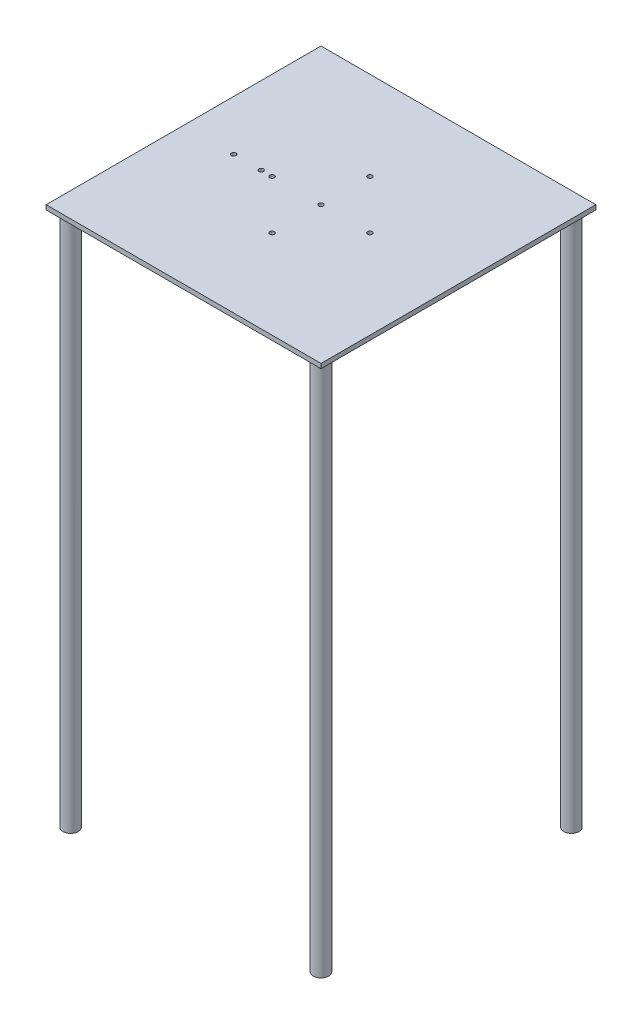
ISO-10303-21;
HEADER;
FILE_DESCRIPTION(('STEP AP214'),'2;1');
FILE_NAME('part.step','',(''),(''),'','','');
FILE_SCHEMA(('AUTOMOTIVE_DESIGN { 1 0 10303 214 1 1 1 1 }'));
ENDSEC;
DATA;
#1=APPLICATION_CONTEXT('core data for automotive mechanical design processes');
#2=APPLICATION_PROTOCOL_DEFINITION('international standard','automotive_design',2000,#1);
#3=PRODUCT_CONTEXT('',#1,'mechanical');
#4=PRODUCT('Part','Part','',(#3));
#5=PRODUCT_RELATED_PRODUCT_CATEGORY('part','',(#4));
#6=PRODUCT_DEFINITION_FORMATION('','',#4);
#7=PRODUCT_DEFINITION_CONTEXT('part definition',#1,'design');
#8=PRODUCT_DEFINITION('design','',#6,#7);
#9=PRODUCT_DEFINITION_SHAPE('','',#8);
#10=(LENGTH_UNIT() NAMED_UNIT(*) SI_UNIT(.MILLI.,.METRE.));
#11=(NAMED_UNIT(*) PLANE_ANGLE_UNIT() SI_UNIT($,.RADIAN.));
#12=(NAMED_UNIT(*) SI_UNIT($,.STERADIAN.) SOLID_ANGLE_UNIT());
#13=UNCERTAINTY_MEASURE_WITH_UNIT(LENGTH_MEASURE(1.E-05),#10,'distance_accuracy_value','');
#14=(GEOMETRIC_REPRESENTATION_CONTEXT(3) GLOBAL_UNCERTAINTY_ASSIGNED_CONTEXT((#13)) GLOBAL_UNIT_ASSIGNED_CONTEXT((#10,
#11,#12)) REPRESENTATION_CONTEXT('',''));
#15=CARTESIAN_POINT('',(0.,0.,0.));
#16=DIRECTION('',(0.,0.,1.));
#17=DIRECTION('',(1.,0.,0.));
#18=AXIS2_PLACEMENT_3D('',#15,#16,#17);
#19=CARTESIAN_POINT('',(0.,3.,0.));
#20=DIRECTION('',(0.,1.,0.));
#21=DIRECTION('',(0.,0.,1.));
#22=AXIS2_PLACEMENT_3D('',#19,#20,#21);
#23=PLANE('',#22);
#24=CARTESIAN_POINT('',(-147.18268,3.,-90.));
#25=DIRECTION('',(0.,1.,0.));
#26=DIRECTION('',(0.,0.,1.));
#27=AXIS2_PLACEMENT_3D('',#24,#25,#26);
#28=CIRCLE('',#27,1.5);
#29=CARTESIAN_POINT('',(-147.18268,3.,-88.5));
#30=VERTEX_POINT('',#29);
#31=EDGE_CURVE('E164',#30,#30,#28,.T.);
#32=ORIENTED_EDGE('',*,*,#31,.F.);
#33=EDGE_LOOP('',(#32));
#34=FACE_BOUND('',#33,.T.);
#35=CARTESIAN_POINT('',(-129.18268,3.,-90.));
#36=DIRECTION('',(0.,1.,0.));
#37=DIRECTION('',(0.,0.,-1.));
#38=AXIS2_PLACEMENT_3D('',#35,#36,#37);
#39=CIRCLE('',#38,1.5);
#40=CARTESIAN_POINT('',(-129.18268,3.,-91.5));
#41=VERTEX_POINT('',#40);
#42=EDGE_CURVE('E352',#41,#41,#39,.T.);
#43=ORIENTED_EDGE('',*,*,#42,.F.);
#44=EDGE_LOOP('',(#43));
#45=FACE_BOUND('',#44,.T.);
#46=CARTESIAN_POINT('',(-90.,3.,-122.));
#47=DIRECTION('',(0.,1.,0.));
#48=DIRECTION('',(0.,0.,1.));
#49=AXIS2_PLACEMENT_3D('',#46,#47,#48);
#50=CIRCLE('',#49,1.5);
#51=CARTESIAN_POINT('',(-90.,3.,-120.5));
#52=VERTEX_POINT('',#51);
#53=EDGE_CURVE('E168',#52,#52,#50,.T.);
#54=ORIENTED_EDGE('',*,*,#53,.F.);
#55=EDGE_LOOP('',(#54));
#56=FACE_BOUND('',#55,.T.);
#57=CARTESIAN_POINT('',(-58.,3.,-90.));
#58=DIRECTION('',(0.,1.,0.));
#59=DIRECTION('',(0.,0.,1.));
#60=AXIS2_PLACEMENT_3D('',#57,#58,#59);
#61=CIRCLE('',#60,1.5);
#62=CARTESIAN_POINT('',(-58.,3.,-88.5));
#63=VERTEX_POINT('',#62);
#64=EDGE_CURVE('E176',#63,#63,#61,.T.);
#65=ORIENTED_EDGE('',*,*,#64,.F.);
#66=EDGE_LOOP('',(#65));
#67=FACE_BOUND('',#66,.T.);
#68=DIRECTION('',(0.,0.,-1.));
#69=VECTOR('',#68,1.);
#70=CARTESIAN_POINT('',(0.,3.,0.));
#71=LINE('',#70,#69);
#72=CARTESIAN_POINT('',(0.,3.,0.));
#73=VERTEX_POINT('',#72);
#74=CARTESIAN_POINT('',(0.,3.,-180.));
#75=VERTEX_POINT('',#74);
#76=EDGE_CURVE('E86',#73,#75,#71,.T.);
#77=ORIENTED_EDGE('',*,*,#76,.T.);
#78=DIRECTION('',(-1.,0.,0.));
#79=VECTOR('',#78,1.);
#80=CARTESIAN_POINT('',(0.,3.,-180.));
#81=LINE('',#80,#79);
#82=CARTESIAN_POINT('',(-180.,3.,-180.));
#83=VERTEX_POINT('',#82);
#84=EDGE_CURVE('E81',#75,#83,#81,.T.);
#85=ORIENTED_EDGE('',*,*,#84,.T.);
#86=DIRECTION('',(0.,0.,1.));
#87=VECTOR('',#86,1.);
#88=CARTESIAN_POINT('',(-180.,3.,0.));
#89=LINE('',#88,#87);
#90=CARTESIAN_POINT('',(-180.,3.,0.));
#91=VERTEX_POINT('',#90);
#92=EDGE_CURVE('E84',#83,#91,#89,.T.);
#93=ORIENTED_EDGE('',*,*,#92,.T.);
#94=DIRECTION('',(1.,0.,0.));
#95=VECTOR('',#94,1.);
#96=CARTESIAN_POINT('',(0.,3.,0.));
#97=LINE('',#96,#95);
#98=EDGE_CURVE('E50',#91,#73,#97,.T.);
#99=ORIENTED_EDGE('',*,*,#98,.T.);
#100=EDGE_LOOP('',(#77,#85,#93,#99));
#101=FACE_BOUND('',#100,.T.);
#102=CARTESIAN_POINT('',(-90.,3.,-90.));
#103=DIRECTION('',(0.,1.,0.));
#104=DIRECTION('',(0.,0.,1.));
#105=AXIS2_PLACEMENT_3D('',#102,#103,#104);
#106=CIRCLE('',#105,1.5);
#107=CARTESIAN_POINT('',(-90.,3.,-88.5));
#108=VERTEX_POINT('',#107);
#109=EDGE_CURVE('E104',#108,#108,#106,.T.);
#110=ORIENTED_EDGE('',*,*,#109,.F.);
#111=EDGE_LOOP('',(#110));
#112=FACE_BOUND('',#111,.T.);
#113=CARTESIAN_POINT('',(-122.,3.,-90.));
#114=DIRECTION('',(0.,1.,0.));
#115=DIRECTION('',(0.,0.,-1.));
#116=AXIS2_PLACEMENT_3D('',#113,#114,#115);
#117=CIRCLE('',#116,1.50000000000001);
#118=CARTESIAN_POINT('',(-122.,3.,-91.5));
#119=VERTEX_POINT('',#118);
#120=EDGE_CURVE('E172',#119,#119,#117,.T.);
#121=ORIENTED_EDGE('',*,*,#120,.F.);
#122=EDGE_LOOP('',(#121));
#123=FACE_BOUND('',#122,.T.);
#124=CARTESIAN_POINT('',(-90.,3.,-58.));
#125=DIRECTION('',(0.,1.,0.));
#126=DIRECTION('',(0.,0.,-1.));
#127=AXIS2_PLACEMENT_3D('',#124,#125,#126);
#128=CIRCLE('',#127,1.5);
#129=CARTESIAN_POINT('',(-90.,3.,-59.5));
#130=VERTEX_POINT('',#129);
#131=EDGE_CURVE('E160',#130,#130,#128,.T.);
#132=ORIENTED_EDGE('',*,*,#131,.F.);
#133=EDGE_LOOP('',(#132));
#134=FACE_BOUND('',#133,.T.);
#135=ADVANCED_FACE('F33',(#34,#45,#56,#67,#101,#112,#123,#134),#23,.T.);
#136=CARTESIAN_POINT('',(0.,0.,0.));
#137=DIRECTION('',(0.,1.,0.));
#138=DIRECTION('',(0.,0.,1.));
#139=AXIS2_PLACEMENT_3D('',#136,#137,#138);
#140=PLANE('',#139);
#141=CARTESIAN_POINT('',(-172.,0.,-172.));
#142=DIRECTION('',(0.,1.,0.));
#143=DIRECTION('',(0.,0.,1.));
#144=AXIS2_PLACEMENT_3D('',#141,#142,#143);
#145=CIRCLE('',#144,4.99999999999998);
#146=CARTESIAN_POINT('',(-172.,0.,-167.));
#147=VERTEX_POINT('',#146);
#148=EDGE_CURVE('E11',#147,#147,#145,.F.);
#149=ORIENTED_EDGE('',*,*,#148,.F.);
#150=EDGE_LOOP('',(#149));
#151=FACE_BOUND('',#150,.T.);
#152=CARTESIAN_POINT('',(-8.00000000000012,0.,-172.));
#153=DIRECTION('',(0.,1.,0.));
#154=DIRECTION('',(0.,0.,1.));
#155=AXIS2_PLACEMENT_3D('',#152,#153,#154);
#156=CIRCLE('',#155,4.99999999999999);
#157=CARTESIAN_POINT('',(-8.00000000000012,0.,-167.));
#158=VERTEX_POINT('',#157);
#159=EDGE_CURVE('E42',#158,#158,#156,.F.);
#160=ORIENTED_EDGE('',*,*,#159,.F.);
#161=EDGE_LOOP('',(#160));
#162=FACE_BOUND('',#161,.T.);
#163=CARTESIAN_POINT('',(-8.00000000000001,0.,-7.99999999999998));
#164=DIRECTION('',(0.,1.,0.));
#165=DIRECTION('',(0.,0.,1.));
#166=AXIS2_PLACEMENT_3D('',#163,#164,#165);
#167=CIRCLE('',#166,4.99999999999999);
#168=CARTESIAN_POINT('',(-8.00000000000001,0.,-2.99999999999999));
#169=VERTEX_POINT('',#168);
#170=EDGE_CURVE('E114',#169,#169,#167,.F.);
#171=ORIENTED_EDGE('',*,*,#170,.F.);
#172=EDGE_LOOP('',(#171));
#173=FACE_BOUND('',#172,.T.);
#174=CARTESIAN_POINT('',(-172.,0.,-8.));
#175=DIRECTION('',(0.,1.,0.));
#176=DIRECTION('',(0.,0.,1.));
#177=AXIS2_PLACEMENT_3D('',#174,#175,#176);
#178=CIRCLE('',#177,4.99999999999999);
#179=CARTESIAN_POINT('',(-172.,0.,-3.00000000000001));
#180=VERTEX_POINT('',#179);
#181=EDGE_CURVE('E111',#180,#180,#178,.F.);
#182=ORIENTED_EDGE('',*,*,#181,.F.);
#183=EDGE_LOOP('',(#182));
#184=FACE_BOUND('',#183,.T.);
#185=CARTESIAN_POINT('',(-147.18268,0.,-90.));
#186=DIRECTION('',(0.,1.,0.));
#187=DIRECTION('',(0.,0.,1.));
#188=AXIS2_PLACEMENT_3D('',#185,#186,#187);
#189=CIRCLE('',#188,1.5);
#190=CARTESIAN_POINT('',(-147.18268,0.,-88.5));
#191=VERTEX_POINT('',#190);
#192=EDGE_CURVE('E133',#191,#191,#189,.T.);
#193=ORIENTED_EDGE('',*,*,#192,.T.);
#194=EDGE_LOOP('',(#193));
#195=FACE_BOUND('',#194,.T.);
#196=CARTESIAN_POINT('',(-129.18268,0.,-90.));
#197=DIRECTION('',(0.,1.,0.));
#198=DIRECTION('',(0.,0.,-1.));
#199=AXIS2_PLACEMENT_3D('',#196,#197,#198);
#200=CIRCLE('',#199,1.5);
#201=CARTESIAN_POINT('',(-129.18268,0.,-91.5));
#202=VERTEX_POINT('',#201);
#203=EDGE_CURVE('E137',#202,#202,#200,.T.);
#204=ORIENTED_EDGE('',*,*,#203,.T.);
#205=EDGE_LOOP('',(#204));
#206=FACE_BOUND('',#205,.T.);
#207=DIRECTION('',(0.,0.,-1.));
#208=VECTOR('',#207,1.);
#209=CARTESIAN_POINT('',(0.,0.,0.));
#210=LINE('',#209,#208);
#211=CARTESIAN_POINT('',(0.,0.,0.));
#212=VERTEX_POINT('',#211);
#213=CARTESIAN_POINT('',(0.,0.,-180.));
#214=VERTEX_POINT('',#213);
#215=EDGE_CURVE('E101',#212,#214,#210,.T.);
#216=ORIENTED_EDGE('',*,*,#215,.F.);
#217=DIRECTION('',(1.,0.,0.));
#218=VECTOR('',#217,1.);
#219=CARTESIAN_POINT('',(0.,0.,0.));
#220=LINE('',#219,#218);
#221=CARTESIAN_POINT('',(-180.,0.,0.));
#222=VERTEX_POINT('',#221);
#223=EDGE_CURVE('E73',#222,#212,#220,.T.);
#224=ORIENTED_EDGE('',*,*,#223,.F.);
#225=DIRECTION('',(0.,0.,1.));
#226=VECTOR('',#225,1.);
#227=CARTESIAN_POINT('',(-180.,0.,0.));
#228=LINE('',#227,#226);
#229=CARTESIAN_POINT('',(-180.,0.,-180.));
#230=VERTEX_POINT('',#229);
#231=EDGE_CURVE('E67',#230,#222,#228,.T.);
#232=ORIENTED_EDGE('',*,*,#231,.F.);
#233=DIRECTION('',(-1.,0.,0.));
#234=VECTOR('',#233,1.);
#235=CARTESIAN_POINT('',(0.,0.,-180.));
#236=LINE('',#235,#234);
#237=EDGE_CURVE('E91',#214,#230,#236,.T.);
#238=ORIENTED_EDGE('',*,*,#237,.F.);
#239=EDGE_LOOP('',(#216,#224,#232,#238));
#240=FACE_BOUND('',#239,.T.);
#241=CARTESIAN_POINT('',(-90.,0.,-90.));
#242=DIRECTION('',(0.,1.,0.));
#243=DIRECTION('',(0.,0.,1.));
#244=AXIS2_PLACEMENT_3D('',#241,#242,#243);
#245=CIRCLE('',#244,1.5);
#246=CARTESIAN_POINT('',(-90.,0.,-88.5));
#247=VERTEX_POINT('',#246);
#248=EDGE_CURVE('E143',#247,#247,#245,.T.);
#249=ORIENTED_EDGE('',*,*,#248,.T.);
#250=EDGE_LOOP('',(#249));
#251=FACE_BOUND('',#250,.T.);
#252=CARTESIAN_POINT('',(-58.,0.,-90.));
#253=DIRECTION('',(0.,1.,0.));
#254=DIRECTION('',(0.,0.,1.));
#255=AXIS2_PLACEMENT_3D('',#252,#253,#254);
#256=CIRCLE('',#255,1.5);
#257=CARTESIAN_POINT('',(-58.,0.,-88.5));
#258=VERTEX_POINT('',#257);
#259=EDGE_CURVE('E147',#258,#258,#256,.T.);
#260=ORIENTED_EDGE('',*,*,#259,.T.);
#261=EDGE_LOOP('',(#260));
#262=FACE_BOUND('',#261,.T.);
#263=CARTESIAN_POINT('',(-122.,0.,-90.));
#264=DIRECTION('',(0.,1.,0.));
#265=DIRECTION('',(0.,0.,-1.));
#266=AXIS2_PLACEMENT_3D('',#263,#264,#265);
#267=CIRCLE('',#266,1.50000000000001);
#268=CARTESIAN_POINT('',(-122.,0.,-91.5));
#269=VERTEX_POINT('',#268);
#270=EDGE_CURVE('E151',#269,#269,#267,.T.);
#271=ORIENTED_EDGE('',*,*,#270,.T.);
#272=EDGE_LOOP('',(#271));
#273=FACE_BOUND('',#272,.T.);
#274=CARTESIAN_POINT('',(-90.,0.,-122.));
#275=DIRECTION('',(0.,1.,0.));
#276=DIRECTION('',(0.,0.,1.));
#277=AXIS2_PLACEMENT_3D('',#274,#275,#276);
#278=CIRCLE('',#277,1.5);
#279=CARTESIAN_POINT('',(-90.,0.,-120.5));
#280=VERTEX_POINT('',#279);
#281=EDGE_CURVE('E155',#280,#280,#278,.T.);
#282=ORIENTED_EDGE('',*,*,#281,.T.);
#283=EDGE_LOOP('',(#282));
#284=FACE_BOUND('',#283,.T.);
#285=CARTESIAN_POINT('',(-90.,0.,-58.));
#286=DIRECTION('',(0.,1.,0.));
#287=DIRECTION('',(0.,0.,-1.));
#288=AXIS2_PLACEMENT_3D('',#285,#286,#287);
#289=CIRCLE('',#288,1.5);
#290=CARTESIAN_POINT('',(-90.,0.,-59.5));
#291=VERTEX_POINT('',#290);
#292=EDGE_CURVE('E158',#291,#291,#289,.T.);
#293=ORIENTED_EDGE('',*,*,#292,.T.);
#294=EDGE_LOOP('',(#293));
#295=FACE_BOUND('',#294,.T.);
#296=ADVANCED_FACE('F121',(#151,#162,#173,#184,#195,#206,#240,#251,#262,#273,#284,#295),#140,.F.);
#297=CARTESIAN_POINT('',(0.,3.,0.));
#298=DIRECTION('',(-1.,0.,0.));
#299=DIRECTION('',(0.,0.,1.));
#300=AXIS2_PLACEMENT_3D('',#297,#298,#299);
#301=PLANE('',#300);
#302=ORIENTED_EDGE('',*,*,#215,.T.);
#303=DIRECTION('',(0.,-1.,0.));
#304=VECTOR('',#303,1.);
#305=CARTESIAN_POINT('',(0.,3.,-180.));
#306=LINE('',#305,#304);
#307=EDGE_CURVE('E92',#75,#214,#306,.T.);
#308=ORIENTED_EDGE('',*,*,#307,.F.);
#309=ORIENTED_EDGE('',*,*,#76,.F.);
#310=DIRECTION('',(0.,-1.,0.));
#311=VECTOR('',#310,1.);
#312=CARTESIAN_POINT('',(0.,3.,0.));
#313=LINE('',#312,#311);
#314=EDGE_CURVE('E97',#73,#212,#313,.T.);
#315=ORIENTED_EDGE('',*,*,#314,.T.);
#316=EDGE_LOOP('',(#302,#308,#309,#315));
#317=FACE_BOUND('',#316,.T.);
#318=ADVANCED_FACE('F35',(#317),#301,.F.);
#319=CARTESIAN_POINT('',(0.,3.,-180.));
#320=DIRECTION('',(0.,0.,1.));
#321=DIRECTION('',(1.,0.,0.));
#322=AXIS2_PLACEMENT_3D('',#319,#320,#321);
#323=PLANE('',#322);
#324=ORIENTED_EDGE('',*,*,#237,.T.);
#325=DIRECTION('',(0.,-1.,0.));
#326=VECTOR('',#325,1.);
#327=CARTESIAN_POINT('',(-180.,3.,-180.));
#328=LINE('',#327,#326);
#329=EDGE_CURVE('E89',#83,#230,#328,.T.);
#330=ORIENTED_EDGE('',*,*,#329,.F.);
#331=ORIENTED_EDGE('',*,*,#84,.F.);
#332=ORIENTED_EDGE('',*,*,#307,.T.);
#333=EDGE_LOOP('',(#324,#330,#331,#332));
#334=FACE_BOUND('',#333,.T.);
#335=ADVANCED_FACE('F90',(#334),#323,.F.);
#336=CARTESIAN_POINT('',(-180.,3.,0.));
#337=DIRECTION('',(1.,0.,0.));
#338=DIRECTION('',(0.,0.,-1.));
#339=AXIS2_PLACEMENT_3D('',#336,#337,#338);
#340=PLANE('',#339);
#341=ORIENTED_EDGE('',*,*,#231,.T.);
#342=DIRECTION('',(0.,-1.,0.));
#343=VECTOR('',#342,1.);
#344=CARTESIAN_POINT('',(-180.,3.,0.));
#345=LINE('',#344,#343);
#346=EDGE_CURVE('E93',#91,#222,#345,.T.);
#347=ORIENTED_EDGE('',*,*,#346,.F.);
#348=ORIENTED_EDGE('',*,*,#92,.F.);
#349=ORIENTED_EDGE('',*,*,#329,.T.);
#350=EDGE_LOOP('',(#341,#347,#348,#349));
#351=FACE_BOUND('',#350,.T.);
#352=ADVANCED_FACE('F95',(#351),#340,.F.);
#353=CARTESIAN_POINT('',(0.,3.,0.));
#354=DIRECTION('',(0.,0.,-1.));
#355=DIRECTION('',(-1.,0.,0.));
#356=AXIS2_PLACEMENT_3D('',#353,#354,#355);
#357=PLANE('',#356);
#358=ORIENTED_EDGE('',*,*,#223,.T.);
#359=ORIENTED_EDGE('',*,*,#314,.F.);
#360=ORIENTED_EDGE('',*,*,#98,.F.);
#361=ORIENTED_EDGE('',*,*,#346,.T.);
#362=EDGE_LOOP('',(#358,#359,#360,#361));
#363=FACE_BOUND('',#362,.T.);
#364=ADVANCED_FACE('F219',(#363),#357,.F.);
#365=CARTESIAN_POINT('',(-90.,3.,-90.));
#366=DIRECTION('',(0.,-1.,0.));
#367=DIRECTION('',(0.,0.,-1.));
#368=AXIS2_PLACEMENT_3D('',#365,#366,#367);
#369=CYLINDRICAL_SURFACE('',#368,1.5);
#370=ORIENTED_EDGE('',*,*,#109,.T.);
#371=EDGE_LOOP('',(#370));
#372=FACE_BOUND('',#371,.T.);
#373=ORIENTED_EDGE('',*,*,#248,.F.);
#374=EDGE_LOOP('',(#373));
#375=FACE_BOUND('',#374,.T.);
#376=ADVANCED_FACE('F184',(#372,#375),#369,.F.);
#377=CARTESIAN_POINT('',(-58.,3.,-90.));
#378=DIRECTION('',(0.,-1.,0.));
#379=DIRECTION('',(0.,0.,-1.));
#380=AXIS2_PLACEMENT_3D('',#377,#378,#379);
#381=CYLINDRICAL_SURFACE('',#380,1.5);
#382=ORIENTED_EDGE('',*,*,#64,.T.);
#383=EDGE_LOOP('',(#382));
#384=FACE_BOUND('',#383,.T.);
#385=ORIENTED_EDGE('',*,*,#259,.F.);
#386=EDGE_LOOP('',(#385));
#387=FACE_BOUND('',#386,.T.);
#388=ADVANCED_FACE('F213',(#384,#387),#381,.F.);
#389=CARTESIAN_POINT('',(-122.,3.,-90.));
#390=DIRECTION('',(0.,-1.,0.));
#391=DIRECTION('',(0.,0.,-1.));
#392=AXIS2_PLACEMENT_3D('',#389,#390,#391);
#393=CYLINDRICAL_SURFACE('',#392,1.50000000000001);
#394=ORIENTED_EDGE('',*,*,#120,.T.);
#395=EDGE_LOOP('',(#394));
#396=FACE_BOUND('',#395,.T.);
#397=ORIENTED_EDGE('',*,*,#270,.F.);
#398=EDGE_LOOP('',(#397));
#399=FACE_BOUND('',#398,.T.);
#400=ADVANCED_FACE('F206',(#396,#399),#393,.F.);
#401=CARTESIAN_POINT('',(-90.,3.,-122.));
#402=DIRECTION('',(0.,-1.,0.));
#403=DIRECTION('',(0.,0.,-1.));
#404=AXIS2_PLACEMENT_3D('',#401,#402,#403);
#405=CYLINDRICAL_SURFACE('',#404,1.5);
#406=ORIENTED_EDGE('',*,*,#53,.T.);
#407=EDGE_LOOP('',(#406));
#408=FACE_BOUND('',#407,.T.);
#409=ORIENTED_EDGE('',*,*,#281,.F.);
#410=EDGE_LOOP('',(#409));
#411=FACE_BOUND('',#410,.T.);
#412=ADVANCED_FACE('F197',(#408,#411),#405,.F.);
#413=CARTESIAN_POINT('',(-90.,3.,-58.));
#414=DIRECTION('',(0.,-1.,0.));
#415=DIRECTION('',(0.,0.,-1.));
#416=AXIS2_PLACEMENT_3D('',#413,#414,#415);
#417=CYLINDRICAL_SURFACE('',#416,1.5);
#418=ORIENTED_EDGE('',*,*,#131,.T.);
#419=EDGE_LOOP('',(#418));
#420=FACE_BOUND('',#419,.T.);
#421=ORIENTED_EDGE('',*,*,#292,.F.);
#422=EDGE_LOOP('',(#421));
#423=FACE_BOUND('',#422,.T.);
#424=ADVANCED_FACE('F194',(#420,#423),#417,.F.);
#425=CARTESIAN_POINT('',(-129.18268,0.,-90.));
#426=DIRECTION('',(0.,1.,0.));
#427=DIRECTION('',(0.,0.,1.));
#428=AXIS2_PLACEMENT_3D('',#425,#426,#427);
#429=CYLINDRICAL_SURFACE('',#428,1.5);
#430=ORIENTED_EDGE('',*,*,#203,.F.);
#431=EDGE_LOOP('',(#430));
#432=FACE_BOUND('',#431,.T.);
#433=ORIENTED_EDGE('',*,*,#42,.T.);
#434=EDGE_LOOP('',(#433));
#435=FACE_BOUND('',#434,.T.);
#436=ADVANCED_FACE('F196',(#432,#435),#429,.F.);
#437=CARTESIAN_POINT('',(-147.18268,0.,-90.));
#438=DIRECTION('',(0.,1.,0.));
#439=DIRECTION('',(0.,0.,1.));
#440=AXIS2_PLACEMENT_3D('',#437,#438,#439);
#441=CYLINDRICAL_SURFACE('',#440,1.5);
#442=ORIENTED_EDGE('',*,*,#192,.F.);
#443=EDGE_LOOP('',(#442));
#444=FACE_BOUND('',#443,.T.);
#445=ORIENTED_EDGE('',*,*,#31,.T.);
#446=EDGE_LOOP('',(#445));
#447=FACE_BOUND('',#446,.T.);
#448=ADVANCED_FACE('F203',(#444,#447),#441,.F.);
#449=CARTESIAN_POINT('',(-172.,-350.,-8.));
#450=DIRECTION('',(0.,1.,0.));
#451=DIRECTION('',(0.,0.,1.));
#452=AXIS2_PLACEMENT_3D('',#449,#450,#451);
#453=CYLINDRICAL_SURFACE('',#452,4.99999999999999);
#454=CARTESIAN_POINT('',(-172.,-350.,-8.));
#455=DIRECTION('',(0.,-1.,0.));
#456=DIRECTION('',(0.,0.,-1.));
#457=AXIS2_PLACEMENT_3D('',#454,#455,#456);
#458=CIRCLE('',#457,4.99999999999999);
#459=CARTESIAN_POINT('',(-172.,-350.,-13.));
#460=VERTEX_POINT('',#459);
#461=EDGE_CURVE('E350',#460,#460,#458,.T.);
#462=ORIENTED_EDGE('',*,*,#461,.F.);
#463=EDGE_LOOP('',(#462));
#464=FACE_BOUND('',#463,.T.);
#465=ORIENTED_EDGE('',*,*,#181,.T.);
#466=EDGE_LOOP('',(#465));
#467=FACE_BOUND('',#466,.T.);
#468=ADVANCED_FACE('F257',(#464,#467),#453,.T.);
#469=CARTESIAN_POINT('',(-172.,-350.,-8.));
#470=DIRECTION('',(0.,-1.,0.));
#471=DIRECTION('',(0.,0.,-1.));
#472=AXIS2_PLACEMENT_3D('',#469,#470,#471);
#473=PLANE('',#472);
#474=ORIENTED_EDGE('',*,*,#461,.T.);
#475=EDGE_LOOP('',(#474));
#476=FACE_BOUND('',#475,.T.);
#477=ADVANCED_FACE('F266',(#476),#473,.T.);
#478=CARTESIAN_POINT('',(-8.00000000000001,-350.,-7.99999999999998));
#479=DIRECTION('',(0.,1.,0.));
#480=DIRECTION('',(0.,0.,1.));
#481=AXIS2_PLACEMENT_3D('',#478,#479,#480);
#482=CYLINDRICAL_SURFACE('',#481,4.99999999999999);
#483=CARTESIAN_POINT('',(-8.00000000000001,-350.,-7.99999999999998));
#484=DIRECTION('',(0.,-1.,0.));
#485=DIRECTION('',(0.,0.,1.));
#486=AXIS2_PLACEMENT_3D('',#483,#484,#485);
#487=CIRCLE('',#486,4.99999999999999);
#488=CARTESIAN_POINT('',(-8.00000000000001,-350.,-2.99999999999999));
#489=VERTEX_POINT('',#488);
#490=EDGE_CURVE('E345',#489,#489,#487,.T.);
#491=ORIENTED_EDGE('',*,*,#490,.F.);
#492=EDGE_LOOP('',(#491));
#493=FACE_BOUND('',#492,.T.);
#494=ORIENTED_EDGE('',*,*,#170,.T.);
#495=EDGE_LOOP('',(#494));
#496=FACE_BOUND('',#495,.T.);
#497=ADVANCED_FACE('F273',(#493,#496),#482,.T.);
#498=CARTESIAN_POINT('',(-8.00000000000001,-350.,-7.99999999999998));
#499=DIRECTION('',(0.,1.,0.));
#500=DIRECTION('',(0.,0.,1.));
#501=AXIS2_PLACEMENT_3D('',#498,#499,#500);
#502=PLANE('',#501);
#503=ORIENTED_EDGE('',*,*,#490,.T.);
#504=EDGE_LOOP('',(#503));
#505=FACE_BOUND('',#504,.T.);
#506=ADVANCED_FACE('F281',(#505),#502,.F.);
#507=CARTESIAN_POINT('',(-8.00000000000012,-350.,-172.));
#508=DIRECTION('',(0.,1.,0.));
#509=DIRECTION('',(0.,0.,1.));
#510=AXIS2_PLACEMENT_3D('',#507,#508,#509);
#511=CYLINDRICAL_SURFACE('',#510,4.99999999999999);
#512=CARTESIAN_POINT('',(-8.00000000000012,-350.,-172.));
#513=DIRECTION('',(0.,-1.,0.));
#514=DIRECTION('',(0.,0.,-1.));
#515=AXIS2_PLACEMENT_3D('',#512,#513,#514);
#516=CIRCLE('',#515,4.99999999999999);
#517=CARTESIAN_POINT('',(-8.00000000000012,-350.,-177.));
#518=VERTEX_POINT('',#517);
#519=EDGE_CURVE('E342',#518,#518,#516,.T.);
#520=ORIENTED_EDGE('',*,*,#519,.F.);
#521=EDGE_LOOP('',(#520));
#522=FACE_BOUND('',#521,.T.);
#523=ORIENTED_EDGE('',*,*,#159,.T.);
#524=EDGE_LOOP('',(#523));
#525=FACE_BOUND('',#524,.T.);
#526=ADVANCED_FACE('F119',(#522,#525),#511,.T.);
#527=CARTESIAN_POINT('',(-8.00000000000012,-350.,-172.));
#528=DIRECTION('',(0.,-1.,0.));
#529=DIRECTION('',(0.,0.,-1.));
#530=AXIS2_PLACEMENT_3D('',#527,#528,#529);
#531=PLANE('',#530);
#532=ORIENTED_EDGE('',*,*,#519,.T.);
#533=EDGE_LOOP('',(#532));
#534=FACE_BOUND('',#533,.T.);
#535=ADVANCED_FACE('F296',(#534),#531,.T.);
#536=CARTESIAN_POINT('',(-172.,-350.,-172.));
#537=DIRECTION('',(0.,1.,0.));
#538=DIRECTION('',(0.,0.,1.));
#539=AXIS2_PLACEMENT_3D('',#536,#537,#538);
#540=CYLINDRICAL_SURFACE('',#539,4.99999999999998);
#541=CARTESIAN_POINT('',(-172.,-350.,-172.));
#542=DIRECTION('',(0.,-1.,0.));
#543=DIRECTION('',(0.,0.,1.));
#544=AXIS2_PLACEMENT_3D('',#541,#542,#543);
#545=CIRCLE('',#544,4.99999999999998);
#546=CARTESIAN_POINT('',(-172.,-350.,-167.));
#547=VERTEX_POINT('',#546);
#548=EDGE_CURVE('E341',#547,#547,#545,.T.);
#549=ORIENTED_EDGE('',*,*,#548,.F.);
#550=EDGE_LOOP('',(#549));
#551=FACE_BOUND('',#550,.T.);
#552=ORIENTED_EDGE('',*,*,#148,.T.);
#553=EDGE_LOOP('',(#552));
#554=FACE_BOUND('',#553,.T.);
#555=ADVANCED_FACE('F304',(#551,#554),#540,.T.);
#556=CARTESIAN_POINT('',(-172.,-350.,-172.));
#557=DIRECTION('',(0.,1.,0.));
#558=DIRECTION('',(0.,0.,1.));
#559=AXIS2_PLACEMENT_3D('',#556,#557,#558);
#560=PLANE('',#559);
#561=ORIENTED_EDGE('',*,*,#548,.T.);
#562=EDGE_LOOP('',(#561));
#563=FACE_BOUND('',#562,.T.);
#564=ADVANCED_FACE('F312',(#563),#560,.F.);
#565=CLOSED_SHELL('',(#135,#296,#318,#335,#352,#364,#376,#388,#400,#412,#424,#436,#448,#468,
#477,#497,#506,#526,#535,#555,#564));
#566=MANIFOLD_SOLID_BREP('B2',#565);
#567=ADVANCED_BREP_SHAPE_REPRESENTATION('',(#18,#566),#14);
#568=SHAPE_DEFINITION_REPRESENTATION(#9,#567);
ENDSEC;
END-ISO-10303-21;
